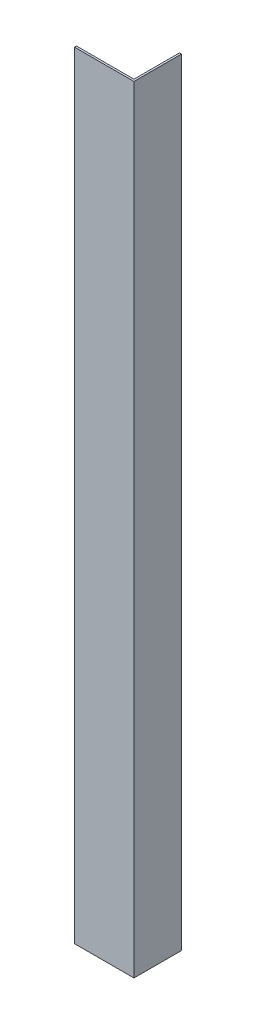
ISO-10303-21;
HEADER;
FILE_DESCRIPTION(('STEP AP214'),'2;1');
FILE_NAME('part.step','',(''),(''),'','','');
FILE_SCHEMA(('AUTOMOTIVE_DESIGN { 1 0 10303 214 1 1 1 1 }'));
ENDSEC;
DATA;
#1=APPLICATION_CONTEXT('core data for automotive mechanical design processes');
#2=APPLICATION_PROTOCOL_DEFINITION('international standard','automotive_design',2000,#1);
#3=PRODUCT_CONTEXT('',#1,'mechanical');
#4=PRODUCT('Part','Part','',(#3));
#5=PRODUCT_RELATED_PRODUCT_CATEGORY('part','',(#4));
#6=PRODUCT_DEFINITION_FORMATION('','',#4);
#7=PRODUCT_DEFINITION_CONTEXT('part definition',#1,'design');
#8=PRODUCT_DEFINITION('design','',#6,#7);
#9=PRODUCT_DEFINITION_SHAPE('','',#8);
#10=(LENGTH_UNIT() NAMED_UNIT(*) SI_UNIT(.MILLI.,.METRE.));
#11=(NAMED_UNIT(*) PLANE_ANGLE_UNIT() SI_UNIT($,.RADIAN.));
#12=(NAMED_UNIT(*) SI_UNIT($,.STERADIAN.) SOLID_ANGLE_UNIT());
#13=UNCERTAINTY_MEASURE_WITH_UNIT(LENGTH_MEASURE(1.E-05),#10,'distance_accuracy_value','');
#14=(GEOMETRIC_REPRESENTATION_CONTEXT(3) GLOBAL_UNCERTAINTY_ASSIGNED_CONTEXT((#13)) GLOBAL_UNIT_ASSIGNED_CONTEXT((#10,
#11,#12)) REPRESENTATION_CONTEXT('',''));
#15=CARTESIAN_POINT('',(0.,0.,0.));
#16=DIRECTION('',(0.,0.,1.));
#17=DIRECTION('',(1.,0.,0.));
#18=AXIS2_PLACEMENT_3D('',#15,#16,#17);
#19=CARTESIAN_POINT('',(0.,196.,-0.5));
#20=DIRECTION('',(1.,0.,0.));
#21=DIRECTION('',(0.,0.,-1.));
#22=AXIS2_PLACEMENT_3D('',#19,#20,#21);
#23=PLANE('',#22);
#24=DIRECTION('',(0.,0.,1.));
#25=VECTOR('',#24,1.);
#26=CARTESIAN_POINT('',(0.,0.,-0.5));
#27=LINE('',#26,#25);
#28=CARTESIAN_POINT('',(0.,0.,-0.5));
#29=VERTEX_POINT('',#28);
#30=CARTESIAN_POINT('',(0.,0.,0.));
#31=VERTEX_POINT('',#30);
#32=EDGE_CURVE('E125',#29,#31,#27,.T.);
#33=ORIENTED_EDGE('',*,*,#32,.T.);
#34=DIRECTION('',(0.,-1.,0.));
#35=VECTOR('',#34,1.);
#36=CARTESIAN_POINT('',(0.,196.,0.));
#37=LINE('',#36,#35);
#38=CARTESIAN_POINT('',(0.,196.,0.));
#39=VERTEX_POINT('',#38);
#40=EDGE_CURVE('E11',#39,#31,#37,.T.);
#41=ORIENTED_EDGE('',*,*,#40,.F.);
#42=DIRECTION('',(0.,0.,1.));
#43=VECTOR('',#42,1.);
#44=CARTESIAN_POINT('',(0.,196.,-0.5));
#45=LINE('',#44,#43);
#46=CARTESIAN_POINT('',(0.,196.,-0.5));
#47=VERTEX_POINT('',#46);
#48=EDGE_CURVE('E135',#47,#39,#45,.T.);
#49=ORIENTED_EDGE('',*,*,#48,.F.);
#50=DIRECTION('',(0.,-1.,0.));
#51=VECTOR('',#50,1.);
#52=CARTESIAN_POINT('',(0.,196.,-0.5));
#53=LINE('',#52,#51);
#54=EDGE_CURVE('E121',#47,#29,#53,.T.);
#55=ORIENTED_EDGE('',*,*,#54,.T.);
#56=EDGE_LOOP('',(#33,#41,#49,#55));
#57=FACE_BOUND('',#56,.T.);
#58=ADVANCED_FACE('F41',(#57),#23,.F.);
#59=CARTESIAN_POINT('',(0.,196.,0.));
#60=DIRECTION('',(0.,0.,-1.));
#61=DIRECTION('',(-1.,0.,0.));
#62=AXIS2_PLACEMENT_3D('',#59,#60,#61);
#63=PLANE('',#62);
#64=DIRECTION('',(1.,0.,0.));
#65=VECTOR('',#64,1.);
#66=CARTESIAN_POINT('',(0.,0.,0.));
#67=LINE('',#66,#65);
#68=CARTESIAN_POINT('',(15.,0.,0.));
#69=VERTEX_POINT('',#68);
#70=EDGE_CURVE('E128',#31,#69,#67,.T.);
#71=ORIENTED_EDGE('',*,*,#70,.T.);
#72=DIRECTION('',(0.,-1.,0.));
#73=VECTOR('',#72,1.);
#74=CARTESIAN_POINT('',(15.,196.,0.));
#75=LINE('',#74,#73);
#76=CARTESIAN_POINT('',(15.,196.,0.));
#77=VERTEX_POINT('',#76);
#78=EDGE_CURVE('E49',#77,#69,#75,.T.);
#79=ORIENTED_EDGE('',*,*,#78,.F.);
#80=DIRECTION('',(1.,0.,0.));
#81=VECTOR('',#80,1.);
#82=CARTESIAN_POINT('',(0.,196.,0.));
#83=LINE('',#82,#81);
#84=EDGE_CURVE('E94',#39,#77,#83,.T.);
#85=ORIENTED_EDGE('',*,*,#84,.F.);
#86=ORIENTED_EDGE('',*,*,#40,.T.);
#87=EDGE_LOOP('',(#71,#79,#85,#86));
#88=FACE_BOUND('',#87,.T.);
#89=ADVANCED_FACE('F159',(#88),#63,.F.);
#90=CARTESIAN_POINT('',(15.,196.,0.));
#91=DIRECTION('',(-1.,0.,0.));
#92=DIRECTION('',(0.,0.,1.));
#93=AXIS2_PLACEMENT_3D('',#90,#91,#92);
#94=PLANE('',#93);
#95=DIRECTION('',(0.,0.,-1.));
#96=VECTOR('',#95,1.);
#97=CARTESIAN_POINT('',(15.,0.,0.));
#98=LINE('',#97,#96);
#99=CARTESIAN_POINT('',(15.,0.,-12.));
#100=VERTEX_POINT('',#99);
#101=EDGE_CURVE('E130',#69,#100,#98,.T.);
#102=ORIENTED_EDGE('',*,*,#101,.T.);
#103=DIRECTION('',(0.,-1.,0.));
#104=VECTOR('',#103,1.);
#105=CARTESIAN_POINT('',(15.,196.,-12.));
#106=LINE('',#105,#104);
#107=CARTESIAN_POINT('',(15.,196.,-12.));
#108=VERTEX_POINT('',#107);
#109=EDGE_CURVE('E116',#108,#100,#106,.T.);
#110=ORIENTED_EDGE('',*,*,#109,.F.);
#111=DIRECTION('',(0.,0.,-1.));
#112=VECTOR('',#111,1.);
#113=CARTESIAN_POINT('',(15.,196.,0.));
#114=LINE('',#113,#112);
#115=EDGE_CURVE('E107',#77,#108,#114,.T.);
#116=ORIENTED_EDGE('',*,*,#115,.F.);
#117=ORIENTED_EDGE('',*,*,#78,.T.);
#118=EDGE_LOOP('',(#102,#110,#116,#117));
#119=FACE_BOUND('',#118,.T.);
#120=ADVANCED_FACE('F141',(#119),#94,.F.);
#121=CARTESIAN_POINT('',(15.,196.,-12.));
#122=DIRECTION('',(0.,0.,1.));
#123=DIRECTION('',(1.,0.,0.));
#124=AXIS2_PLACEMENT_3D('',#121,#122,#123);
#125=PLANE('',#124);
#126=DIRECTION('',(-1.,0.,0.));
#127=VECTOR('',#126,1.);
#128=CARTESIAN_POINT('',(15.,0.,-12.));
#129=LINE('',#128,#127);
#130=CARTESIAN_POINT('',(14.5,0.,-12.));
#131=VERTEX_POINT('',#130);
#132=EDGE_CURVE('E115',#100,#131,#129,.T.);
#133=ORIENTED_EDGE('',*,*,#132,.T.);
#134=DIRECTION('',(0.,-1.,0.));
#135=VECTOR('',#134,1.);
#136=CARTESIAN_POINT('',(14.5,196.,-12.));
#137=LINE('',#136,#135);
#138=CARTESIAN_POINT('',(14.5,196.,-12.));
#139=VERTEX_POINT('',#138);
#140=EDGE_CURVE('E112',#139,#131,#137,.T.);
#141=ORIENTED_EDGE('',*,*,#140,.F.);
#142=DIRECTION('',(-1.,0.,0.));
#143=VECTOR('',#142,1.);
#144=CARTESIAN_POINT('',(15.,196.,-12.));
#145=LINE('',#144,#143);
#146=EDGE_CURVE('E101',#108,#139,#145,.T.);
#147=ORIENTED_EDGE('',*,*,#146,.F.);
#148=ORIENTED_EDGE('',*,*,#109,.T.);
#149=EDGE_LOOP('',(#133,#141,#147,#148));
#150=FACE_BOUND('',#149,.T.);
#151=ADVANCED_FACE('F113',(#150),#125,.F.);
#152=CARTESIAN_POINT('',(14.5,196.,-12.));
#153=DIRECTION('',(1.,0.,0.));
#154=DIRECTION('',(0.,0.,-1.));
#155=AXIS2_PLACEMENT_3D('',#152,#153,#154);
#156=PLANE('',#155);
#157=DIRECTION('',(0.,0.,1.));
#158=VECTOR('',#157,1.);
#159=CARTESIAN_POINT('',(14.5,0.,-12.));
#160=LINE('',#159,#158);
#161=CARTESIAN_POINT('',(14.5,0.,-0.500000000000002));
#162=VERTEX_POINT('',#161);
#163=EDGE_CURVE('E80',#131,#162,#160,.T.);
#164=ORIENTED_EDGE('',*,*,#163,.T.);
#165=DIRECTION('',(0.,-1.,0.));
#166=VECTOR('',#165,1.);
#167=CARTESIAN_POINT('',(14.5,196.,-0.500000000000002));
#168=LINE('',#167,#166);
#169=CARTESIAN_POINT('',(14.5,196.,-0.500000000000002));
#170=VERTEX_POINT('',#169);
#171=EDGE_CURVE('E117',#170,#162,#168,.T.);
#172=ORIENTED_EDGE('',*,*,#171,.F.);
#173=DIRECTION('',(0.,0.,1.));
#174=VECTOR('',#173,1.);
#175=CARTESIAN_POINT('',(14.5,196.,-12.));
#176=LINE('',#175,#174);
#177=EDGE_CURVE('E105',#139,#170,#176,.T.);
#178=ORIENTED_EDGE('',*,*,#177,.F.);
#179=ORIENTED_EDGE('',*,*,#140,.T.);
#180=EDGE_LOOP('',(#164,#172,#178,#179));
#181=FACE_BOUND('',#180,.T.);
#182=ADVANCED_FACE('F119',(#181),#156,.F.);
#183=CARTESIAN_POINT('',(14.5,196.,-0.500000000000002));
#184=DIRECTION('',(0.,0.,1.));
#185=DIRECTION('',(1.,0.,0.));
#186=AXIS2_PLACEMENT_3D('',#183,#184,#185);
#187=PLANE('',#186);
#188=DIRECTION('',(-1.,0.,0.));
#189=VECTOR('',#188,1.);
#190=CARTESIAN_POINT('',(14.5,0.,-0.500000000000002));
#191=LINE('',#190,#189);
#192=EDGE_CURVE('E86',#162,#29,#191,.T.);
#193=ORIENTED_EDGE('',*,*,#192,.T.);
#194=ORIENTED_EDGE('',*,*,#54,.F.);
#195=DIRECTION('',(-1.,0.,0.));
#196=VECTOR('',#195,1.);
#197=CARTESIAN_POINT('',(14.5,196.,-0.500000000000002));
#198=LINE('',#197,#196);
#199=EDGE_CURVE('E57',#170,#47,#198,.T.);
#200=ORIENTED_EDGE('',*,*,#199,.F.);
#201=ORIENTED_EDGE('',*,*,#171,.T.);
#202=EDGE_LOOP('',(#193,#194,#200,#201));
#203=FACE_BOUND('',#202,.T.);
#204=ADVANCED_FACE('F148',(#203),#187,.F.);
#205=CARTESIAN_POINT('',(0.,196.,0.));
#206=DIRECTION('',(0.,1.,0.));
#207=DIRECTION('',(0.,0.,1.));
#208=AXIS2_PLACEMENT_3D('',#205,#206,#207);
#209=PLANE('',#208);
#210=ORIENTED_EDGE('',*,*,#48,.T.);
#211=ORIENTED_EDGE('',*,*,#84,.T.);
#212=ORIENTED_EDGE('',*,*,#115,.T.);
#213=ORIENTED_EDGE('',*,*,#146,.T.);
#214=ORIENTED_EDGE('',*,*,#177,.T.);
#215=ORIENTED_EDGE('',*,*,#199,.T.);
#216=EDGE_LOOP('',(#210,#211,#212,#213,#214,#215));
#217=FACE_BOUND('',#216,.T.);
#218=ADVANCED_FACE('F103',(#217),#209,.T.);
#219=CARTESIAN_POINT('',(0.,0.,0.));
#220=DIRECTION('',(0.,1.,0.));
#221=DIRECTION('',(0.,0.,1.));
#222=AXIS2_PLACEMENT_3D('',#219,#220,#221);
#223=PLANE('',#222);
#224=ORIENTED_EDGE('',*,*,#32,.F.);
#225=ORIENTED_EDGE('',*,*,#192,.F.);
#226=ORIENTED_EDGE('',*,*,#163,.F.);
#227=ORIENTED_EDGE('',*,*,#132,.F.);
#228=ORIENTED_EDGE('',*,*,#101,.F.);
#229=ORIENTED_EDGE('',*,*,#70,.F.);
#230=EDGE_LOOP('',(#224,#225,#226,#227,#228,#229));
#231=FACE_BOUND('',#230,.T.);
#232=ADVANCED_FACE('F144',(#231),#223,.F.);
#233=CLOSED_SHELL('',(#58,#89,#120,#151,#182,#204,#218,#232));
#234=MANIFOLD_SOLID_BREP('B2',#233);
#235=ADVANCED_BREP_SHAPE_REPRESENTATION('',(#18,#234),#14);
#236=SHAPE_DEFINITION_REPRESENTATION(#9,#235);
ENDSEC;
END-ISO-10303-21;
